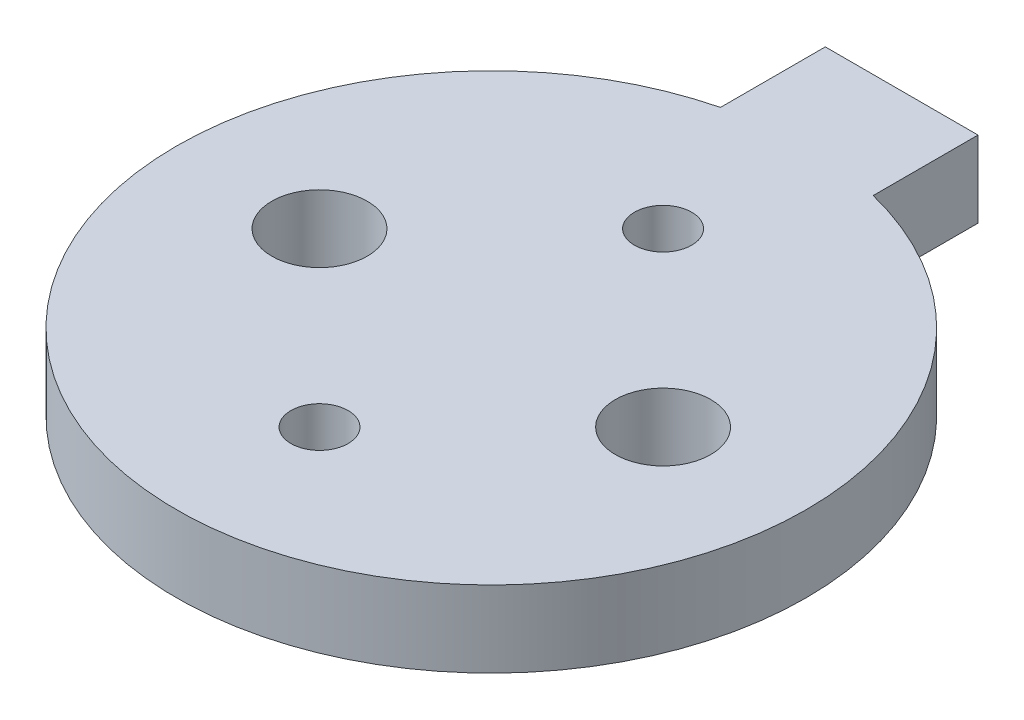
ISO-10303-21;
HEADER;
FILE_DESCRIPTION(('STEP AP214'),'2;1');
FILE_NAME('part.step','',(''),(''),'','','');
FILE_SCHEMA(('AUTOMOTIVE_DESIGN { 1 0 10303 214 1 1 1 1 }'));
ENDSEC;
DATA;
#1=APPLICATION_CONTEXT('core data for automotive mechanical design processes');
#2=APPLICATION_PROTOCOL_DEFINITION('international standard','automotive_design',2000,#1);
#3=PRODUCT_CONTEXT('',#1,'mechanical');
#4=PRODUCT('Part','Part','',(#3));
#5=PRODUCT_RELATED_PRODUCT_CATEGORY('part','',(#4));
#6=PRODUCT_DEFINITION_FORMATION('','',#4);
#7=PRODUCT_DEFINITION_CONTEXT('part definition',#1,'design');
#8=PRODUCT_DEFINITION('design','',#6,#7);
#9=PRODUCT_DEFINITION_SHAPE('','',#8);
#10=(LENGTH_UNIT() NAMED_UNIT(*) SI_UNIT(.MILLI.,.METRE.));
#11=(NAMED_UNIT(*) PLANE_ANGLE_UNIT() SI_UNIT($,.RADIAN.));
#12=(NAMED_UNIT(*) SI_UNIT($,.STERADIAN.) SOLID_ANGLE_UNIT());
#13=UNCERTAINTY_MEASURE_WITH_UNIT(LENGTH_MEASURE(1.E-05),#10,'distance_accuracy_value','');
#14=(GEOMETRIC_REPRESENTATION_CONTEXT(3) GLOBAL_UNCERTAINTY_ASSIGNED_CONTEXT((#13)) GLOBAL_UNIT_ASSIGNED_CONTEXT((#10,
#11,#12)) REPRESENTATION_CONTEXT('',''));
#15=CARTESIAN_POINT('',(0.,0.,0.));
#16=DIRECTION('',(0.,0.,1.));
#17=DIRECTION('',(1.,0.,0.));
#18=AXIS2_PLACEMENT_3D('',#15,#16,#17);
#19=CARTESIAN_POINT('',(0.,8.,0.));
#20=DIRECTION('',(0.,-1.,0.));
#21=DIRECTION('',(0.,0.,-1.));
#22=AXIS2_PLACEMENT_3D('',#19,#20,#21);
#23=CYLINDRICAL_SURFACE('',#22,33.);
#24=CARTESIAN_POINT('',(0.,0.,0.));
#25=DIRECTION('',(0.,1.,0.));
#26=DIRECTION('',(0.,0.,1.));
#27=AXIS2_PLACEMENT_3D('',#24,#25,#26);
#28=CIRCLE('',#27,33.);
#29=CARTESIAN_POINT('',(-8.,0.,-32.0156211871642));
#30=VERTEX_POINT('',#29);
#31=CARTESIAN_POINT('',(8.,0.,-32.0156211871642));
#32=VERTEX_POINT('',#31);
#33=EDGE_CURVE('E43',#30,#32,#28,.T.);
#34=ORIENTED_EDGE('',*,*,#33,.T.);
#35=DIRECTION('',(0.,1.,0.));
#36=VECTOR('',#35,1.);
#37=CARTESIAN_POINT('',(8.,-19.4076422551498,-32.0156211871642));
#38=LINE('',#37,#36);
#39=CARTESIAN_POINT('',(8.,8.,-32.0156211871642));
#40=VERTEX_POINT('',#39);
#41=EDGE_CURVE('E58',#32,#40,#38,.T.);
#42=ORIENTED_EDGE('',*,*,#41,.T.);
#43=CARTESIAN_POINT('',(0.,8.,0.));
#44=DIRECTION('',(0.,1.,0.));
#45=DIRECTION('',(0.,0.,1.));
#46=AXIS2_PLACEMENT_3D('',#43,#44,#45);
#47=CIRCLE('',#46,33.);
#48=CARTESIAN_POINT('',(-8.,8.,-32.0156211871642));
#49=VERTEX_POINT('',#48);
#50=EDGE_CURVE('E11',#49,#40,#47,.T.);
#51=ORIENTED_EDGE('',*,*,#50,.F.);
#52=DIRECTION('',(0.,1.,0.));
#53=VECTOR('',#52,1.);
#54=CARTESIAN_POINT('',(-8.,-19.4076422551498,-32.0156211871642));
#55=LINE('',#54,#53);
#56=EDGE_CURVE('E118',#30,#49,#55,.T.);
#57=ORIENTED_EDGE('',*,*,#56,.F.);
#58=EDGE_LOOP('',(#34,#42,#51,#57));
#59=FACE_BOUND('',#58,.T.);
#60=ADVANCED_FACE('F40',(#59),#23,.T.);
#61=CARTESIAN_POINT('',(0.,8.,0.));
#62=DIRECTION('',(0.,1.,0.));
#63=DIRECTION('',(0.,0.,1.));
#64=AXIS2_PLACEMENT_3D('',#61,#62,#63);
#65=PLANE('',#64);
#66=CARTESIAN_POINT('',(0.,8.,-18.));
#67=DIRECTION('',(0.,1.,0.));
#68=DIRECTION('',(0.,0.,1.));
#69=AXIS2_PLACEMENT_3D('',#66,#67,#68);
#70=CIRCLE('',#69,3.);
#71=CARTESIAN_POINT('',(0.,8.,-15.));
#72=VERTEX_POINT('',#71);
#73=EDGE_CURVE('E108',#72,#72,#70,.T.);
#74=ORIENTED_EDGE('',*,*,#73,.F.);
#75=EDGE_LOOP('',(#74));
#76=FACE_BOUND('',#75,.T.);
#77=CARTESIAN_POINT('',(-18.,8.,0.));
#78=DIRECTION('',(0.,1.,0.));
#79=DIRECTION('',(0.,0.,1.));
#80=AXIS2_PLACEMENT_3D('',#77,#78,#79);
#81=CIRCLE('',#80,5.);
#82=CARTESIAN_POINT('',(-18.,8.,5.));
#83=VERTEX_POINT('',#82);
#84=EDGE_CURVE('E150',#83,#83,#81,.T.);
#85=ORIENTED_EDGE('',*,*,#84,.F.);
#86=EDGE_LOOP('',(#85));
#87=FACE_BOUND('',#86,.T.);
#88=CARTESIAN_POINT('',(0.,8.,18.));
#89=DIRECTION('',(0.,1.,0.));
#90=DIRECTION('',(0.,0.,-1.));
#91=AXIS2_PLACEMENT_3D('',#88,#89,#90);
#92=CIRCLE('',#91,3.);
#93=CARTESIAN_POINT('',(0.,8.,15.));
#94=VERTEX_POINT('',#93);
#95=EDGE_CURVE('E142',#94,#94,#92,.T.);
#96=ORIENTED_EDGE('',*,*,#95,.F.);
#97=EDGE_LOOP('',(#96));
#98=FACE_BOUND('',#97,.T.);
#99=CARTESIAN_POINT('',(18.,8.,0.));
#100=DIRECTION('',(0.,1.,0.));
#101=DIRECTION('',(0.,0.,-1.));
#102=AXIS2_PLACEMENT_3D('',#99,#100,#101);
#103=CIRCLE('',#102,5.);
#104=CARTESIAN_POINT('',(18.,8.,-5.));
#105=VERTEX_POINT('',#104);
#106=EDGE_CURVE('E134',#105,#105,#103,.T.);
#107=ORIENTED_EDGE('',*,*,#106,.F.);
#108=EDGE_LOOP('',(#107));
#109=FACE_BOUND('',#108,.T.);
#110=ORIENTED_EDGE('',*,*,#50,.T.);
#111=DIRECTION('',(0.,0.,-1.));
#112=VECTOR('',#111,1.);
#113=CARTESIAN_POINT('',(8.,8.,-43.));
#114=LINE('',#113,#112);
#115=CARTESIAN_POINT('',(8.,8.,-43.));
#116=VERTEX_POINT('',#115);
#117=EDGE_CURVE('E83',#40,#116,#114,.T.);
#118=ORIENTED_EDGE('',*,*,#117,.T.);
#119=DIRECTION('',(-1.,0.,0.));
#120=VECTOR('',#119,1.);
#121=CARTESIAN_POINT('',(-8.,8.,-43.));
#122=LINE('',#121,#120);
#123=CARTESIAN_POINT('',(-8.,8.,-43.));
#124=VERTEX_POINT('',#123);
#125=EDGE_CURVE('E93',#116,#124,#122,.T.);
#126=ORIENTED_EDGE('',*,*,#125,.T.);
#127=DIRECTION('',(0.,0.,1.));
#128=VECTOR('',#127,1.);
#129=CARTESIAN_POINT('',(-8.,8.,-43.));
#130=LINE('',#129,#128);
#131=EDGE_CURVE('E90',#124,#49,#130,.T.);
#132=ORIENTED_EDGE('',*,*,#131,.T.);
#133=EDGE_LOOP('',(#110,#118,#126,#132));
#134=FACE_BOUND('',#133,.T.);
#135=ADVANCED_FACE('F101',(#76,#87,#98,#109,#134),#65,.T.);
#136=CARTESIAN_POINT('',(0.,0.,0.));
#137=DIRECTION('',(0.,1.,0.));
#138=DIRECTION('',(0.,0.,1.));
#139=AXIS2_PLACEMENT_3D('',#136,#137,#138);
#140=PLANE('',#139);
#141=CARTESIAN_POINT('',(0.,0.,-18.));
#142=DIRECTION('',(0.,1.,0.));
#143=DIRECTION('',(0.,0.,1.));
#144=AXIS2_PLACEMENT_3D('',#141,#142,#143);
#145=CIRCLE('',#144,3.);
#146=CARTESIAN_POINT('',(0.,0.,-15.));
#147=VERTEX_POINT('',#146);
#148=EDGE_CURVE('E103',#147,#147,#145,.T.);
#149=ORIENTED_EDGE('',*,*,#148,.T.);
#150=EDGE_LOOP('',(#149));
#151=FACE_BOUND('',#150,.T.);
#152=CARTESIAN_POINT('',(-18.,0.,0.));
#153=DIRECTION('',(0.,1.,0.));
#154=DIRECTION('',(0.,0.,1.));
#155=AXIS2_PLACEMENT_3D('',#152,#153,#154);
#156=CIRCLE('',#155,5.);
#157=CARTESIAN_POINT('',(-18.,0.,5.));
#158=VERTEX_POINT('',#157);
#159=EDGE_CURVE('E154',#158,#158,#156,.T.);
#160=ORIENTED_EDGE('',*,*,#159,.T.);
#161=EDGE_LOOP('',(#160));
#162=FACE_BOUND('',#161,.T.);
#163=CARTESIAN_POINT('',(0.,0.,18.));
#164=DIRECTION('',(0.,1.,0.));
#165=DIRECTION('',(0.,0.,-1.));
#166=AXIS2_PLACEMENT_3D('',#163,#164,#165);
#167=CIRCLE('',#166,3.);
#168=CARTESIAN_POINT('',(0.,0.,15.));
#169=VERTEX_POINT('',#168);
#170=EDGE_CURVE('E146',#169,#169,#167,.T.);
#171=ORIENTED_EDGE('',*,*,#170,.T.);
#172=EDGE_LOOP('',(#171));
#173=FACE_BOUND('',#172,.T.);
#174=CARTESIAN_POINT('',(18.,0.,0.));
#175=DIRECTION('',(0.,1.,0.));
#176=DIRECTION('',(0.,0.,-1.));
#177=AXIS2_PLACEMENT_3D('',#174,#175,#176);
#178=CIRCLE('',#177,5.);
#179=CARTESIAN_POINT('',(18.,0.,-5.));
#180=VERTEX_POINT('',#179);
#181=EDGE_CURVE('E138',#180,#180,#178,.T.);
#182=ORIENTED_EDGE('',*,*,#181,.T.);
#183=EDGE_LOOP('',(#182));
#184=FACE_BOUND('',#183,.T.);
#185=ORIENTED_EDGE('',*,*,#33,.F.);
#186=DIRECTION('',(0.,0.,-1.));
#187=VECTOR('',#186,1.);
#188=CARTESIAN_POINT('',(-8.,0.,-43.));
#189=LINE('',#188,#187);
#190=CARTESIAN_POINT('',(-8.,0.,-43.));
#191=VERTEX_POINT('',#190);
#192=EDGE_CURVE('E117',#30,#191,#189,.T.);
#193=ORIENTED_EDGE('',*,*,#192,.T.);
#194=DIRECTION('',(1.,0.,0.));
#195=VECTOR('',#194,1.);
#196=CARTESIAN_POINT('',(-8.,0.,-43.));
#197=LINE('',#196,#195);
#198=CARTESIAN_POINT('',(8.,0.,-43.));
#199=VERTEX_POINT('',#198);
#200=EDGE_CURVE('E123',#191,#199,#197,.T.);
#201=ORIENTED_EDGE('',*,*,#200,.T.);
#202=DIRECTION('',(0.,0.,1.));
#203=VECTOR('',#202,1.);
#204=CARTESIAN_POINT('',(8.,0.,-43.));
#205=LINE('',#204,#203);
#206=EDGE_CURVE('E85',#199,#32,#205,.T.);
#207=ORIENTED_EDGE('',*,*,#206,.T.);
#208=EDGE_LOOP('',(#185,#193,#201,#207));
#209=FACE_BOUND('',#208,.T.);
#210=ADVANCED_FACE('F167',(#151,#162,#173,#184,#209),#140,.F.);
#211=CARTESIAN_POINT('',(8.,-19.4076422551498,-43.));
#212=DIRECTION('',(1.,0.,0.));
#213=DIRECTION('',(0.,0.,-1.));
#214=AXIS2_PLACEMENT_3D('',#211,#212,#213);
#215=PLANE('',#214);
#216=ORIENTED_EDGE('',*,*,#206,.F.);
#217=DIRECTION('',(0.,1.,0.));
#218=VECTOR('',#217,1.);
#219=CARTESIAN_POINT('',(8.,-19.4076422551498,-43.));
#220=LINE('',#219,#218);
#221=EDGE_CURVE('E79',#199,#116,#220,.T.);
#222=ORIENTED_EDGE('',*,*,#221,.T.);
#223=ORIENTED_EDGE('',*,*,#117,.F.);
#224=ORIENTED_EDGE('',*,*,#41,.F.);
#225=EDGE_LOOP('',(#216,#222,#223,#224));
#226=FACE_BOUND('',#225,.T.);
#227=ADVANCED_FACE('F81',(#226),#215,.T.);
#228=CARTESIAN_POINT('',(-8.,-19.4076422551498,-43.));
#229=DIRECTION('',(-1.,0.,0.));
#230=DIRECTION('',(0.,0.,1.));
#231=AXIS2_PLACEMENT_3D('',#228,#229,#230);
#232=PLANE('',#231);
#233=ORIENTED_EDGE('',*,*,#192,.F.);
#234=ORIENTED_EDGE('',*,*,#56,.T.);
#235=ORIENTED_EDGE('',*,*,#131,.F.);
#236=DIRECTION('',(0.,1.,0.));
#237=VECTOR('',#236,1.);
#238=CARTESIAN_POINT('',(-8.,-19.4076422551498,-43.));
#239=LINE('',#238,#237);
#240=EDGE_CURVE('E89',#191,#124,#239,.T.);
#241=ORIENTED_EDGE('',*,*,#240,.F.);
#242=EDGE_LOOP('',(#233,#234,#235,#241));
#243=FACE_BOUND('',#242,.T.);
#244=ADVANCED_FACE('F187',(#243),#232,.T.);
#245=CARTESIAN_POINT('',(-8.,-19.4076422551498,-43.));
#246=DIRECTION('',(0.,0.,-1.));
#247=DIRECTION('',(-1.,0.,0.));
#248=AXIS2_PLACEMENT_3D('',#245,#246,#247);
#249=PLANE('',#248);
#250=ORIENTED_EDGE('',*,*,#200,.F.);
#251=ORIENTED_EDGE('',*,*,#240,.T.);
#252=ORIENTED_EDGE('',*,*,#125,.F.);
#253=ORIENTED_EDGE('',*,*,#221,.F.);
#254=EDGE_LOOP('',(#250,#251,#252,#253));
#255=FACE_BOUND('',#254,.T.);
#256=ADVANCED_FACE('F94',(#255),#249,.T.);
#257=CARTESIAN_POINT('',(18.,0.,0.));
#258=DIRECTION('',(0.,1.,0.));
#259=DIRECTION('',(0.,0.,1.));
#260=AXIS2_PLACEMENT_3D('',#257,#258,#259);
#261=CYLINDRICAL_SURFACE('',#260,5.);
#262=ORIENTED_EDGE('',*,*,#181,.F.);
#263=EDGE_LOOP('',(#262));
#264=FACE_BOUND('',#263,.T.);
#265=ORIENTED_EDGE('',*,*,#106,.T.);
#266=EDGE_LOOP('',(#265));
#267=FACE_BOUND('',#266,.T.);
#268=ADVANCED_FACE('F175',(#264,#267),#261,.F.);
#269=CARTESIAN_POINT('',(0.,0.,18.));
#270=DIRECTION('',(0.,1.,0.));
#271=DIRECTION('',(0.,0.,1.));
#272=AXIS2_PLACEMENT_3D('',#269,#270,#271);
#273=CYLINDRICAL_SURFACE('',#272,3.);
#274=ORIENTED_EDGE('',*,*,#170,.F.);
#275=EDGE_LOOP('',(#274));
#276=FACE_BOUND('',#275,.T.);
#277=ORIENTED_EDGE('',*,*,#95,.T.);
#278=EDGE_LOOP('',(#277));
#279=FACE_BOUND('',#278,.T.);
#280=ADVANCED_FACE('F177',(#276,#279),#273,.F.);
#281=CARTESIAN_POINT('',(-18.,0.,0.));
#282=DIRECTION('',(0.,1.,0.));
#283=DIRECTION('',(0.,0.,1.));
#284=AXIS2_PLACEMENT_3D('',#281,#282,#283);
#285=CYLINDRICAL_SURFACE('',#284,5.);
#286=ORIENTED_EDGE('',*,*,#159,.F.);
#287=EDGE_LOOP('',(#286));
#288=FACE_BOUND('',#287,.T.);
#289=ORIENTED_EDGE('',*,*,#84,.T.);
#290=EDGE_LOOP('',(#289));
#291=FACE_BOUND('',#290,.T.);
#292=ADVANCED_FACE('F184',(#288,#291),#285,.F.);
#293=CARTESIAN_POINT('',(0.,0.,-18.));
#294=DIRECTION('',(0.,1.,0.));
#295=DIRECTION('',(0.,0.,1.));
#296=AXIS2_PLACEMENT_3D('',#293,#294,#295);
#297=CYLINDRICAL_SURFACE('',#296,3.);
#298=ORIENTED_EDGE('',*,*,#148,.F.);
#299=EDGE_LOOP('',(#298));
#300=FACE_BOUND('',#299,.T.);
#301=ORIENTED_EDGE('',*,*,#73,.T.);
#302=EDGE_LOOP('',(#301));
#303=FACE_BOUND('',#302,.T.);
#304=ADVANCED_FACE('F163',(#300,#303),#297,.F.);
#305=CLOSED_SHELL('',(#60,#135,#210,#227,#244,#256,#268,#280,#292,#304));
#306=MANIFOLD_SOLID_BREP('B2',#305);
#307=ADVANCED_BREP_SHAPE_REPRESENTATION('',(#18,#306),#14);
#308=SHAPE_DEFINITION_REPRESENTATION(#9,#307);
ENDSEC;
END-ISO-10303-21;
